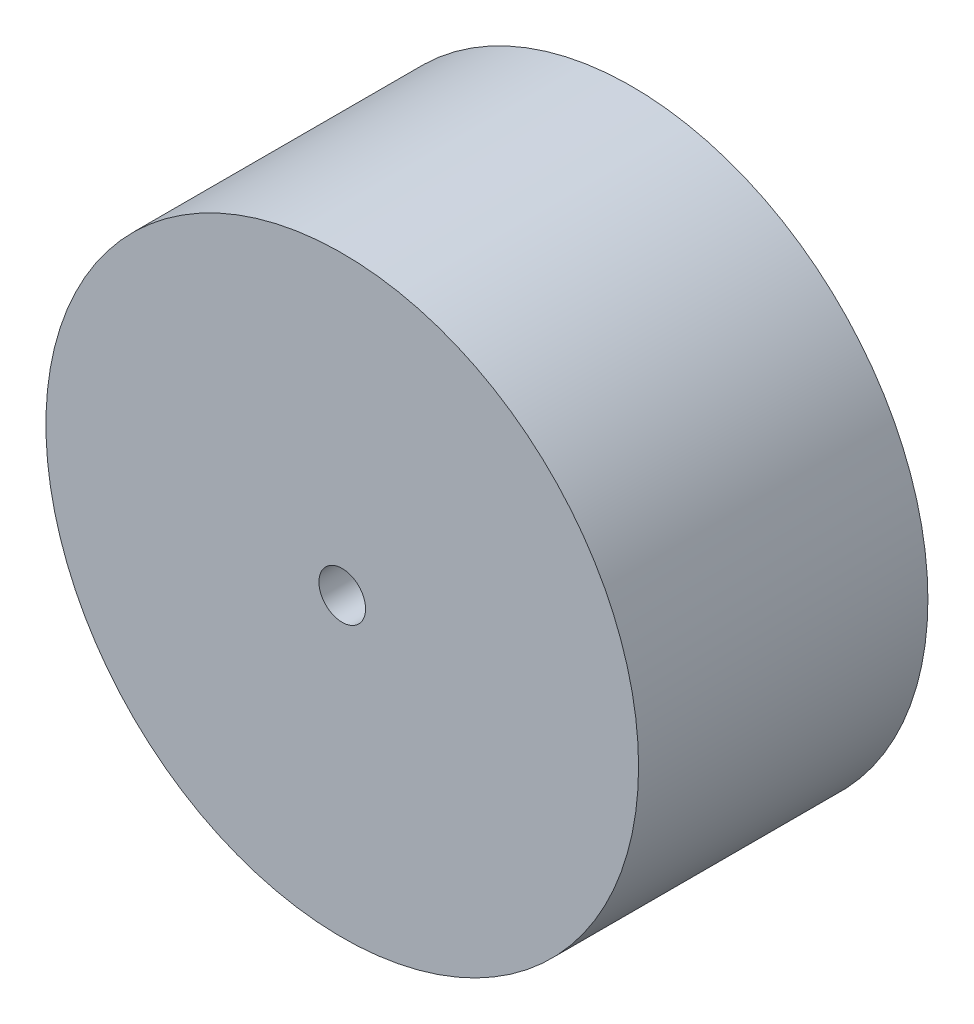
ISO-10303-21;
HEADER;
FILE_DESCRIPTION(('STEP AP214'),'2;1');
FILE_NAME('part.step','',(''),(''),'','','');
FILE_SCHEMA(('AUTOMOTIVE_DESIGN { 1 0 10303 214 1 1 1 1 }'));
ENDSEC;
DATA;
#1=APPLICATION_CONTEXT('core data for automotive mechanical design processes');
#2=APPLICATION_PROTOCOL_DEFINITION('international standard','automotive_design',2000,#1);
#3=PRODUCT_CONTEXT('',#1,'mechanical');
#4=PRODUCT('Part','Part','',(#3));
#5=PRODUCT_RELATED_PRODUCT_CATEGORY('part','',(#4));
#6=PRODUCT_DEFINITION_FORMATION('','',#4);
#7=PRODUCT_DEFINITION_CONTEXT('part definition',#1,'design');
#8=PRODUCT_DEFINITION('design','',#6,#7);
#9=PRODUCT_DEFINITION_SHAPE('','',#8);
#10=(LENGTH_UNIT() NAMED_UNIT(*) SI_UNIT(.MILLI.,.METRE.));
#11=(NAMED_UNIT(*) PLANE_ANGLE_UNIT() SI_UNIT($,.RADIAN.));
#12=(NAMED_UNIT(*) SI_UNIT($,.STERADIAN.) SOLID_ANGLE_UNIT());
#13=UNCERTAINTY_MEASURE_WITH_UNIT(LENGTH_MEASURE(1.E-05),#10,'distance_accuracy_value','');
#14=(GEOMETRIC_REPRESENTATION_CONTEXT(3) GLOBAL_UNCERTAINTY_ASSIGNED_CONTEXT((#13)) GLOBAL_UNIT_ASSIGNED_CONTEXT((#10,
#11,#12)) REPRESENTATION_CONTEXT('',''));
#15=CARTESIAN_POINT('',(0.,0.,0.));
#16=DIRECTION('',(0.,0.,1.));
#17=DIRECTION('',(1.,0.,0.));
#18=AXIS2_PLACEMENT_3D('',#15,#16,#17);
#19=CARTESIAN_POINT('',(0.,0.,62.));
#20=DIRECTION('',(0.,0.,-1.));
#21=DIRECTION('',(-1.,0.,0.));
#22=AXIS2_PLACEMENT_3D('',#19,#20,#21);
#23=CYLINDRICAL_SURFACE('',#22,63.5);
#24=CARTESIAN_POINT('',(0.,0.,62.));
#25=DIRECTION('',(0.,0.,1.));
#26=DIRECTION('',(1.,0.,0.));
#27=AXIS2_PLACEMENT_3D('',#24,#25,#26);
#28=CIRCLE('',#27,63.5);
#29=CARTESIAN_POINT('',(63.5,0.,62.));
#30=VERTEX_POINT('',#29);
#31=EDGE_CURVE('E10',#30,#30,#28,.T.);
#32=ORIENTED_EDGE('',*,*,#31,.F.);
#33=EDGE_LOOP('',(#32));
#34=FACE_BOUND('',#33,.T.);
#35=CARTESIAN_POINT('',(0.,0.,0.));
#36=DIRECTION('',(0.,0.,1.));
#37=DIRECTION('',(1.,0.,0.));
#38=AXIS2_PLACEMENT_3D('',#35,#36,#37);
#39=CIRCLE('',#38,63.5);
#40=CARTESIAN_POINT('',(63.5,0.,0.));
#41=VERTEX_POINT('',#40);
#42=EDGE_CURVE('E37',#41,#41,#39,.T.);
#43=ORIENTED_EDGE('',*,*,#42,.T.);
#44=EDGE_LOOP('',(#43));
#45=FACE_BOUND('',#44,.T.);
#46=ADVANCED_FACE('F34',(#34,#45),#23,.T.);
#47=CARTESIAN_POINT('',(0.,0.,62.));
#48=DIRECTION('',(0.,0.,1.));
#49=DIRECTION('',(1.,0.,0.));
#50=AXIS2_PLACEMENT_3D('',#47,#48,#49);
#51=PLANE('',#50);
#52=CARTESIAN_POINT('',(0.,0.,62.));
#53=DIRECTION('',(0.,0.,-1.));
#54=DIRECTION('',(-1.,0.,0.));
#55=AXIS2_PLACEMENT_3D('',#52,#53,#54);
#56=CIRCLE('',#55,5.);
#57=CARTESIAN_POINT('',(-5.,0.,62.));
#58=VERTEX_POINT('',#57);
#59=EDGE_CURVE('E46',#58,#58,#56,.T.);
#60=ORIENTED_EDGE('',*,*,#59,.T.);
#61=EDGE_LOOP('',(#60));
#62=FACE_BOUND('',#61,.T.);
#63=ORIENTED_EDGE('',*,*,#31,.T.);
#64=EDGE_LOOP('',(#63));
#65=FACE_BOUND('',#64,.T.);
#66=ADVANCED_FACE('F55',(#62,#65),#51,.T.);
#67=CARTESIAN_POINT('',(0.,0.,0.));
#68=DIRECTION('',(0.,0.,1.));
#69=DIRECTION('',(1.,0.,0.));
#70=AXIS2_PLACEMENT_3D('',#67,#68,#69);
#71=PLANE('',#70);
#72=CARTESIAN_POINT('',(0.,0.,0.));
#73=DIRECTION('',(0.,0.,-1.));
#74=DIRECTION('',(-1.,0.,0.));
#75=AXIS2_PLACEMENT_3D('',#72,#73,#74);
#76=CIRCLE('',#75,5.);
#77=CARTESIAN_POINT('',(-5.,0.,0.));
#78=VERTEX_POINT('',#77);
#79=EDGE_CURVE('E48',#78,#78,#76,.T.);
#80=ORIENTED_EDGE('',*,*,#79,.F.);
#81=EDGE_LOOP('',(#80));
#82=FACE_BOUND('',#81,.T.);
#83=ORIENTED_EDGE('',*,*,#42,.F.);
#84=EDGE_LOOP('',(#83));
#85=FACE_BOUND('',#84,.T.);
#86=ADVANCED_FACE('F60',(#82,#85),#71,.F.);
#87=CARTESIAN_POINT('',(0.,0.,62.));
#88=DIRECTION('',(0.,0.,-1.));
#89=DIRECTION('',(-1.,0.,0.));
#90=AXIS2_PLACEMENT_3D('',#87,#88,#89);
#91=CYLINDRICAL_SURFACE('',#90,5.);
#92=ORIENTED_EDGE('',*,*,#59,.F.);
#93=EDGE_LOOP('',(#92));
#94=FACE_BOUND('',#93,.T.);
#95=ORIENTED_EDGE('',*,*,#79,.T.);
#96=EDGE_LOOP('',(#95));
#97=FACE_BOUND('',#96,.T.);
#98=ADVANCED_FACE('F57',(#94,#97),#91,.F.);
#99=CLOSED_SHELL('',(#46,#66,#86,#98));
#100=MANIFOLD_SOLID_BREP('B2',#99);
#101=ADVANCED_BREP_SHAPE_REPRESENTATION('',(#18,#100),#14);
#102=SHAPE_DEFINITION_REPRESENTATION(#9,#101);
ENDSEC;
END-ISO-10303-21;
